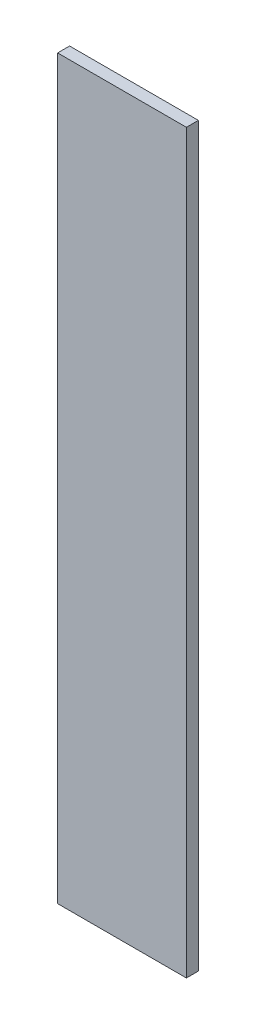
ISO-10303-21;
HEADER;
FILE_DESCRIPTION(('STEP AP214'),'2;1');
FILE_NAME('part.step','',(''),(''),'','','');
FILE_SCHEMA(('AUTOMOTIVE_DESIGN { 1 0 10303 214 1 1 1 1 }'));
ENDSEC;
DATA;
#1=APPLICATION_CONTEXT('core data for automotive mechanical design processes');
#2=APPLICATION_PROTOCOL_DEFINITION('international standard','automotive_design',2000,#1);
#3=PRODUCT_CONTEXT('',#1,'mechanical');
#4=PRODUCT('Part','Part','',(#3));
#5=PRODUCT_RELATED_PRODUCT_CATEGORY('part','',(#4));
#6=PRODUCT_DEFINITION_FORMATION('','',#4);
#7=PRODUCT_DEFINITION_CONTEXT('part definition',#1,'design');
#8=PRODUCT_DEFINITION('design','',#6,#7);
#9=PRODUCT_DEFINITION_SHAPE('','',#8);
#10=(LENGTH_UNIT() NAMED_UNIT(*) SI_UNIT(.MILLI.,.METRE.));
#11=(NAMED_UNIT(*) PLANE_ANGLE_UNIT() SI_UNIT($,.RADIAN.));
#12=(NAMED_UNIT(*) SI_UNIT($,.STERADIAN.) SOLID_ANGLE_UNIT());
#13=UNCERTAINTY_MEASURE_WITH_UNIT(LENGTH_MEASURE(1.E-05),#10,'distance_accuracy_value','');
#14=(GEOMETRIC_REPRESENTATION_CONTEXT(3) GLOBAL_UNCERTAINTY_ASSIGNED_CONTEXT((#13)) GLOBAL_UNIT_ASSIGNED_CONTEXT((#10,
#11,#12)) REPRESENTATION_CONTEXT('',''));
#15=CARTESIAN_POINT('',(0.,0.,0.));
#16=DIRECTION('',(0.,0.,1.));
#17=DIRECTION('',(1.,0.,0.));
#18=AXIS2_PLACEMENT_3D('',#15,#16,#17);
#19=CARTESIAN_POINT('',(-30.9125,20.86875,5.));
#20=DIRECTION('',(1.,0.,0.));
#21=DIRECTION('',(0.,1.,0.));
#22=AXIS2_PLACEMENT_3D('',#19,#20,#21);
#23=PLANE('',#22);
#24=DIRECTION('',(0.,-1.,0.));
#25=VECTOR('',#24,1.);
#26=CARTESIAN_POINT('',(-30.9125,20.86875,0.));
#27=LINE('',#26,#25);
#28=CARTESIAN_POINT('',(-30.9125,20.86875,0.));
#29=VERTEX_POINT('',#28);
#30=CARTESIAN_POINT('',(-30.9125,-286.63125,0.));
#31=VERTEX_POINT('',#30);
#32=EDGE_CURVE('E100',#29,#31,#27,.T.);
#33=ORIENTED_EDGE('',*,*,#32,.T.);
#34=DIRECTION('',(0.,0.,-1.));
#35=VECTOR('',#34,1.);
#36=CARTESIAN_POINT('',(-30.9125,-286.63125,5.));
#37=LINE('',#36,#35);
#38=CARTESIAN_POINT('',(-30.9125,-286.63125,5.));
#39=VERTEX_POINT('',#38);
#40=EDGE_CURVE('E11',#39,#31,#37,.T.);
#41=ORIENTED_EDGE('',*,*,#40,.F.);
#42=DIRECTION('',(0.,-1.,0.));
#43=VECTOR('',#42,1.);
#44=CARTESIAN_POINT('',(-30.9125,20.86875,5.));
#45=LINE('',#44,#43);
#46=CARTESIAN_POINT('',(-30.9125,20.86875,5.));
#47=VERTEX_POINT('',#46);
#48=EDGE_CURVE('E88',#47,#39,#45,.T.);
#49=ORIENTED_EDGE('',*,*,#48,.F.);
#50=DIRECTION('',(0.,0.,-1.));
#51=VECTOR('',#50,1.);
#52=CARTESIAN_POINT('',(-30.9125,20.86875,5.));
#53=LINE('',#52,#51);
#54=EDGE_CURVE('E96',#47,#29,#53,.T.);
#55=ORIENTED_EDGE('',*,*,#54,.T.);
#56=EDGE_LOOP('',(#33,#41,#49,#55));
#57=FACE_BOUND('',#56,.T.);
#58=ADVANCED_FACE('F37',(#57),#23,.F.);
#59=CARTESIAN_POINT('',(-30.9125,-286.63125,5.));
#60=DIRECTION('',(0.,1.,0.));
#61=DIRECTION('',(0.,0.,1.));
#62=AXIS2_PLACEMENT_3D('',#59,#60,#61);
#63=PLANE('',#62);
#64=DIRECTION('',(1.,0.,0.));
#65=VECTOR('',#64,1.);
#66=CARTESIAN_POINT('',(-30.9125,-286.63125,0.));
#67=LINE('',#66,#65);
#68=CARTESIAN_POINT('',(22.8375,-286.63125,0.));
#69=VERTEX_POINT('',#68);
#70=EDGE_CURVE('E92',#31,#69,#67,.T.);
#71=ORIENTED_EDGE('',*,*,#70,.T.);
#72=DIRECTION('',(0.,0.,-1.));
#73=VECTOR('',#72,1.);
#74=CARTESIAN_POINT('',(22.8375,-286.63125,5.));
#75=LINE('',#74,#73);
#76=CARTESIAN_POINT('',(22.8375,-286.63125,5.));
#77=VERTEX_POINT('',#76);
#78=EDGE_CURVE('E45',#77,#69,#75,.T.);
#79=ORIENTED_EDGE('',*,*,#78,.F.);
#80=DIRECTION('',(1.,0.,0.));
#81=VECTOR('',#80,1.);
#82=CARTESIAN_POINT('',(-30.9125,-286.63125,5.));
#83=LINE('',#82,#81);
#84=EDGE_CURVE('E83',#39,#77,#83,.T.);
#85=ORIENTED_EDGE('',*,*,#84,.F.);
#86=ORIENTED_EDGE('',*,*,#40,.T.);
#87=EDGE_LOOP('',(#71,#79,#85,#86));
#88=FACE_BOUND('',#87,.T.);
#89=ADVANCED_FACE('F91',(#88),#63,.F.);
#90=CARTESIAN_POINT('',(22.8375,20.86875,5.));
#91=DIRECTION('',(-1.,0.,0.));
#92=DIRECTION('',(0.,-1.,0.));
#93=AXIS2_PLACEMENT_3D('',#90,#91,#92);
#94=PLANE('',#93);
#95=DIRECTION('',(0.,1.,0.));
#96=VECTOR('',#95,1.);
#97=CARTESIAN_POINT('',(22.8375,20.86875,0.));
#98=LINE('',#97,#96);
#99=CARTESIAN_POINT('',(22.8375,20.86875,0.));
#100=VERTEX_POINT('',#99);
#101=EDGE_CURVE('E70',#69,#100,#98,.T.);
#102=ORIENTED_EDGE('',*,*,#101,.T.);
#103=DIRECTION('',(0.,0.,-1.));
#104=VECTOR('',#103,1.);
#105=CARTESIAN_POINT('',(22.8375,20.86875,5.));
#106=LINE('',#105,#104);
#107=CARTESIAN_POINT('',(22.8375,20.86875,5.));
#108=VERTEX_POINT('',#107);
#109=EDGE_CURVE('E93',#108,#100,#106,.T.);
#110=ORIENTED_EDGE('',*,*,#109,.F.);
#111=DIRECTION('',(0.,1.,0.));
#112=VECTOR('',#111,1.);
#113=CARTESIAN_POINT('',(22.8375,20.86875,5.));
#114=LINE('',#113,#112);
#115=EDGE_CURVE('E86',#77,#108,#114,.T.);
#116=ORIENTED_EDGE('',*,*,#115,.F.);
#117=ORIENTED_EDGE('',*,*,#78,.T.);
#118=EDGE_LOOP('',(#102,#110,#116,#117));
#119=FACE_BOUND('',#118,.T.);
#120=ADVANCED_FACE('F94',(#119),#94,.F.);
#121=CARTESIAN_POINT('',(-30.9125,20.86875,5.));
#122=DIRECTION('',(0.,-1.,0.));
#123=DIRECTION('',(0.,0.,-1.));
#124=AXIS2_PLACEMENT_3D('',#121,#122,#123);
#125=PLANE('',#124);
#126=DIRECTION('',(-1.,0.,0.));
#127=VECTOR('',#126,1.);
#128=CARTESIAN_POINT('',(-30.9125,20.86875,0.));
#129=LINE('',#128,#127);
#130=EDGE_CURVE('E76',#100,#29,#129,.T.);
#131=ORIENTED_EDGE('',*,*,#130,.T.);
#132=ORIENTED_EDGE('',*,*,#54,.F.);
#133=DIRECTION('',(-1.,0.,0.));
#134=VECTOR('',#133,1.);
#135=CARTESIAN_POINT('',(-30.9125,20.86875,5.));
#136=LINE('',#135,#134);
#137=EDGE_CURVE('E53',#108,#47,#136,.T.);
#138=ORIENTED_EDGE('',*,*,#137,.F.);
#139=ORIENTED_EDGE('',*,*,#109,.T.);
#140=EDGE_LOOP('',(#131,#132,#138,#139));
#141=FACE_BOUND('',#140,.T.);
#142=ADVANCED_FACE('F107',(#141),#125,.F.);
#143=CARTESIAN_POINT('',(0.,0.,5.));
#144=DIRECTION('',(0.,0.,1.));
#145=DIRECTION('',(1.,0.,0.));
#146=AXIS2_PLACEMENT_3D('',#143,#144,#145);
#147=PLANE('',#146);
#148=ORIENTED_EDGE('',*,*,#48,.T.);
#149=ORIENTED_EDGE('',*,*,#84,.T.);
#150=ORIENTED_EDGE('',*,*,#115,.T.);
#151=ORIENTED_EDGE('',*,*,#137,.T.);
#152=EDGE_LOOP('',(#148,#149,#150,#151));
#153=FACE_BOUND('',#152,.T.);
#154=ADVANCED_FACE('F84',(#153),#147,.T.);
#155=CARTESIAN_POINT('',(0.,0.,0.));
#156=DIRECTION('',(0.,0.,1.));
#157=DIRECTION('',(1.,0.,0.));
#158=AXIS2_PLACEMENT_3D('',#155,#156,#157);
#159=PLANE('',#158);
#160=ORIENTED_EDGE('',*,*,#32,.F.);
#161=ORIENTED_EDGE('',*,*,#130,.F.);
#162=ORIENTED_EDGE('',*,*,#101,.F.);
#163=ORIENTED_EDGE('',*,*,#70,.F.);
#164=EDGE_LOOP('',(#160,#161,#162,#163));
#165=FACE_BOUND('',#164,.T.);
#166=ADVANCED_FACE('F110',(#165),#159,.F.);
#167=CLOSED_SHELL('',(#58,#89,#120,#142,#154,#166));
#168=MANIFOLD_SOLID_BREP('B2',#167);
#169=ADVANCED_BREP_SHAPE_REPRESENTATION('',(#18,#168),#14);
#170=SHAPE_DEFINITION_REPRESENTATION(#9,#169);
ENDSEC;
END-ISO-10303-21;
